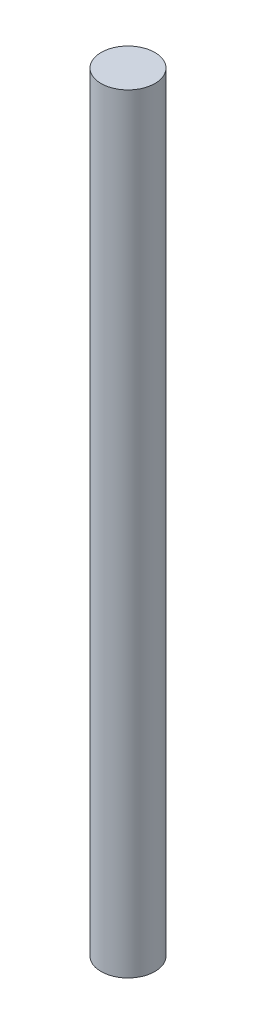
ISO-10303-21;
HEADER;
FILE_DESCRIPTION(('STEP AP214'),'2;1');
FILE_NAME('part.step','',(''),(''),'','','');
FILE_SCHEMA(('AUTOMOTIVE_DESIGN { 1 0 10303 214 1 1 1 1 }'));
ENDSEC;
DATA;
#1=APPLICATION_CONTEXT('core data for automotive mechanical design processes');
#2=APPLICATION_PROTOCOL_DEFINITION('international standard','automotive_design',2000,#1);
#3=PRODUCT_CONTEXT('',#1,'mechanical');
#4=PRODUCT('Part','Part','',(#3));
#5=PRODUCT_RELATED_PRODUCT_CATEGORY('part','',(#4));
#6=PRODUCT_DEFINITION_FORMATION('','',#4);
#7=PRODUCT_DEFINITION_CONTEXT('part definition',#1,'design');
#8=PRODUCT_DEFINITION('design','',#6,#7);
#9=PRODUCT_DEFINITION_SHAPE('','',#8);
#10=(LENGTH_UNIT() NAMED_UNIT(*) SI_UNIT(.MILLI.,.METRE.));
#11=(NAMED_UNIT(*) PLANE_ANGLE_UNIT() SI_UNIT($,.RADIAN.));
#12=(NAMED_UNIT(*) SI_UNIT($,.STERADIAN.) SOLID_ANGLE_UNIT());
#13=UNCERTAINTY_MEASURE_WITH_UNIT(LENGTH_MEASURE(1.E-05),#10,'distance_accuracy_value','');
#14=(GEOMETRIC_REPRESENTATION_CONTEXT(3) GLOBAL_UNCERTAINTY_ASSIGNED_CONTEXT((#13)) GLOBAL_UNIT_ASSIGNED_CONTEXT((#10,
#11,#12)) REPRESENTATION_CONTEXT('',''));
#15=CARTESIAN_POINT('',(0.,0.,0.));
#16=DIRECTION('',(0.,0.,1.));
#17=DIRECTION('',(1.,0.,0.));
#18=AXIS2_PLACEMENT_3D('',#15,#16,#17);
#19=CARTESIAN_POINT('',(0.,228.6,0.));
#20=DIRECTION('',(0.,-1.,0.));
#21=DIRECTION('',(0.,0.,-1.));
#22=AXIS2_PLACEMENT_3D('',#19,#20,#21);
#23=CYLINDRICAL_SURFACE('',#22,8.);
#24=CARTESIAN_POINT('',(0.,228.6,0.));
#25=DIRECTION('',(0.,1.,0.));
#26=DIRECTION('',(0.,0.,1.));
#27=AXIS2_PLACEMENT_3D('',#24,#25,#26);
#28=CIRCLE('',#27,8.);
#29=CARTESIAN_POINT('',(0.,228.6,8.));
#30=VERTEX_POINT('',#29);
#31=EDGE_CURVE('E10',#30,#30,#28,.T.);
#32=ORIENTED_EDGE('',*,*,#31,.F.);
#33=EDGE_LOOP('',(#32));
#34=FACE_BOUND('',#33,.T.);
#35=CARTESIAN_POINT('',(0.,0.,0.));
#36=DIRECTION('',(0.,1.,0.));
#37=DIRECTION('',(0.,0.,1.));
#38=AXIS2_PLACEMENT_3D('',#35,#36,#37);
#39=CIRCLE('',#38,8.);
#40=CARTESIAN_POINT('',(0.,0.,8.));
#41=VERTEX_POINT('',#40);
#42=EDGE_CURVE('E34',#41,#41,#39,.T.);
#43=ORIENTED_EDGE('',*,*,#42,.T.);
#44=EDGE_LOOP('',(#43));
#45=FACE_BOUND('',#44,.T.);
#46=ADVANCED_FACE('F31',(#34,#45),#23,.T.);
#47=CARTESIAN_POINT('',(0.,228.6,0.));
#48=DIRECTION('',(0.,1.,0.));
#49=DIRECTION('',(0.,0.,1.));
#50=AXIS2_PLACEMENT_3D('',#47,#48,#49);
#51=PLANE('',#50);
#52=ORIENTED_EDGE('',*,*,#31,.T.);
#53=EDGE_LOOP('',(#52));
#54=FACE_BOUND('',#53,.T.);
#55=ADVANCED_FACE('F46',(#54),#51,.T.);
#56=CARTESIAN_POINT('',(0.,0.,0.));
#57=DIRECTION('',(0.,1.,0.));
#58=DIRECTION('',(0.,0.,1.));
#59=AXIS2_PLACEMENT_3D('',#56,#57,#58);
#60=PLANE('',#59);
#61=ORIENTED_EDGE('',*,*,#42,.F.);
#62=EDGE_LOOP('',(#61));
#63=FACE_BOUND('',#62,.T.);
#64=ADVANCED_FACE('F44',(#63),#60,.F.);
#65=CLOSED_SHELL('',(#46,#55,#64));
#66=MANIFOLD_SOLID_BREP('B2',#65);
#67=ADVANCED_BREP_SHAPE_REPRESENTATION('',(#18,#66),#14);
#68=SHAPE_DEFINITION_REPRESENTATION(#9,#67);
ENDSEC;
END-ISO-10303-21;
